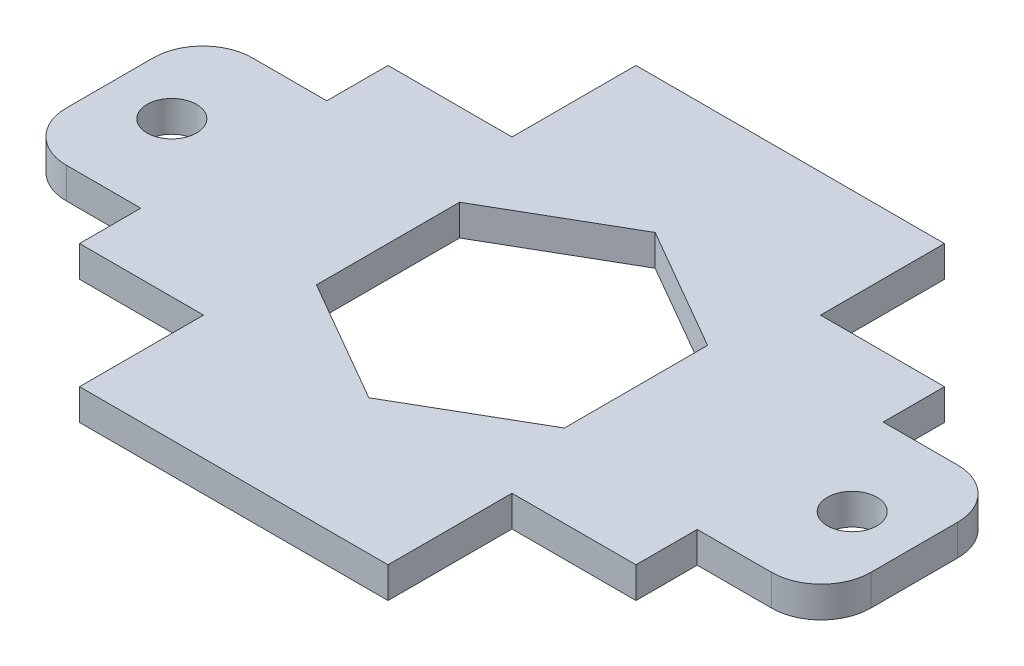
ISO-10303-21;
HEADER;
FILE_DESCRIPTION(('STEP AP214'),'2;1');
FILE_NAME('part.step','',(''),(''),'','','');
FILE_SCHEMA(('AUTOMOTIVE_DESIGN { 1 0 10303 214 1 1 1 1 }'));
ENDSEC;
DATA;
#1=APPLICATION_CONTEXT('core data for automotive mechanical design processes');
#2=APPLICATION_PROTOCOL_DEFINITION('international standard','automotive_design',2000,#1);
#3=PRODUCT_CONTEXT('',#1,'mechanical');
#4=PRODUCT('Part','Part','',(#3));
#5=PRODUCT_RELATED_PRODUCT_CATEGORY('part','',(#4));
#6=PRODUCT_DEFINITION_FORMATION('','',#4);
#7=PRODUCT_DEFINITION_CONTEXT('part definition',#1,'design');
#8=PRODUCT_DEFINITION('design','',#6,#7);
#9=PRODUCT_DEFINITION_SHAPE('','',#8);
#10=(LENGTH_UNIT() NAMED_UNIT(*) SI_UNIT(.MILLI.,.METRE.));
#11=(NAMED_UNIT(*) PLANE_ANGLE_UNIT() SI_UNIT($,.RADIAN.));
#12=(NAMED_UNIT(*) SI_UNIT($,.STERADIAN.) SOLID_ANGLE_UNIT());
#13=UNCERTAINTY_MEASURE_WITH_UNIT(LENGTH_MEASURE(1.E-05),#10,'distance_accuracy_value','');
#14=(GEOMETRIC_REPRESENTATION_CONTEXT(3) GLOBAL_UNCERTAINTY_ASSIGNED_CONTEXT((#13)) GLOBAL_UNIT_ASSIGNED_CONTEXT((#10,
#11,#12)) REPRESENTATION_CONTEXT('',''));
#15=CARTESIAN_POINT('',(0.,0.,0.));
#16=DIRECTION('',(0.,0.,1.));
#17=DIRECTION('',(1.,0.,0.));
#18=AXIS2_PLACEMENT_3D('',#15,#16,#17);
#19=CARTESIAN_POINT('',(-36.1199938,3.175,-4.44499999999998));
#20=DIRECTION('',(0.,1.,0.));
#21=DIRECTION('',(0.,0.,1.));
#22=AXIS2_PLACEMENT_3D('',#19,#20,#21);
#23=PLANE('',#22);
#24=CARTESIAN_POINT('',(-34.8499938,3.175,0.));
#25=DIRECTION('',(0.,1.,0.));
#26=DIRECTION('',(0.,0.,1.));
#27=AXIS2_PLACEMENT_3D('',#24,#25,#26);
#28=CIRCLE('',#27,2.54);
#29=CARTESIAN_POINT('',(-34.8499938,3.175,2.54000000000002));
#30=VERTEX_POINT('',#29);
#31=EDGE_CURVE('E266',#30,#30,#28,.T.);
#32=ORIENTED_EDGE('',*,*,#31,.F.);
#33=EDGE_LOOP('',(#32));
#34=FACE_BOUND('',#33,.T.);
#35=DIRECTION('',(-1.,0.,0.));
#36=VECTOR('',#35,1.);
#37=CARTESIAN_POINT('',(-28.4999938,3.175,-9.52499999999998));
#38=LINE('',#37,#36);
#39=CARTESIAN_POINT('',(-28.4999938,3.175,-9.52499999999998));
#40=VERTEX_POINT('',#39);
#41=CARTESIAN_POINT('',(-36.1199938000001,3.175,-9.52499999999998));
#42=VERTEX_POINT('',#41);
#43=EDGE_CURVE('E286',#40,#42,#38,.T.);
#44=ORIENTED_EDGE('',*,*,#43,.T.);
#45=CARTESIAN_POINT('',(-36.1199938,3.175,-4.44499999999998));
#46=DIRECTION('',(0.,1.,0.));
#47=DIRECTION('',(0.,0.,1.));
#48=AXIS2_PLACEMENT_3D('',#45,#46,#47);
#49=CIRCLE('',#48,5.08);
#50=CARTESIAN_POINT('',(-41.1999938,3.175,-4.44499999999998));
#51=VERTEX_POINT('',#50);
#52=EDGE_CURVE('E289',#42,#51,#49,.T.);
#53=ORIENTED_EDGE('',*,*,#52,.T.);
#54=DIRECTION('',(0.,0.,1.));
#55=VECTOR('',#54,1.);
#56=CARTESIAN_POINT('',(-41.1999938,3.175,4.44500000000002));
#57=LINE('',#56,#55);
#58=CARTESIAN_POINT('',(-41.1999938,3.175,4.44500000000002));
#59=VERTEX_POINT('',#58);
#60=EDGE_CURVE('E292',#51,#59,#57,.T.);
#61=ORIENTED_EDGE('',*,*,#60,.T.);
#62=CARTESIAN_POINT('',(-36.1199938,3.175,4.44500000000002));
#63=DIRECTION('',(0.,1.,0.));
#64=DIRECTION('',(0.,0.,-1.));
#65=AXIS2_PLACEMENT_3D('',#62,#63,#64);
#66=CIRCLE('',#65,5.08);
#67=CARTESIAN_POINT('',(-36.1199938000001,3.175,9.52500000000002));
#68=VERTEX_POINT('',#67);
#69=EDGE_CURVE('E294',#59,#68,#66,.T.);
#70=ORIENTED_EDGE('',*,*,#69,.T.);
#71=DIRECTION('',(1.,0.,0.));
#72=VECTOR('',#71,1.);
#73=CARTESIAN_POINT('',(-28.4999938,3.175,9.52500000000002));
#74=LINE('',#73,#72);
#75=CARTESIAN_POINT('',(-28.4999938,3.175,9.52500000000002));
#76=VERTEX_POINT('',#75);
#77=EDGE_CURVE('E296',#68,#76,#74,.T.);
#78=ORIENTED_EDGE('',*,*,#77,.T.);
#79=DIRECTION('',(0.,0.,1.));
#80=VECTOR('',#79,1.);
#81=CARTESIAN_POINT('',(-28.4999938,3.175,9.52500000000002));
#82=LINE('',#81,#80);
#83=CARTESIAN_POINT('',(-28.4999938,3.175,15.7999938));
#84=VERTEX_POINT('',#83);
#85=EDGE_CURVE('E298',#76,#84,#82,.T.);
#86=ORIENTED_EDGE('',*,*,#85,.T.);
#87=DIRECTION('',(1.,0.,0.));
#88=VECTOR('',#87,1.);
#89=CARTESIAN_POINT('',(-15.7999938,3.175,15.7999938));
#90=LINE('',#89,#88);
#91=CARTESIAN_POINT('',(-15.7999938,3.175,15.7999938));
#92=VERTEX_POINT('',#91);
#93=EDGE_CURVE('E300',#84,#92,#90,.T.);
#94=ORIENTED_EDGE('',*,*,#93,.T.);
#95=DIRECTION('',(0.,0.,1.));
#96=VECTOR('',#95,1.);
#97=CARTESIAN_POINT('',(-15.7999938,3.175,15.7999938));
#98=LINE('',#97,#96);
#99=CARTESIAN_POINT('',(-15.7999938,3.175,28.4999938));
#100=VERTEX_POINT('',#99);
#101=EDGE_CURVE('E302',#92,#100,#98,.T.);
#102=ORIENTED_EDGE('',*,*,#101,.T.);
#103=DIRECTION('',(1.,0.,0.));
#104=VECTOR('',#103,1.);
#105=CARTESIAN_POINT('',(15.7999938,3.175,28.4999938));
#106=LINE('',#105,#104);
#107=CARTESIAN_POINT('',(15.7999938,3.175,28.4999938));
#108=VERTEX_POINT('',#107);
#109=EDGE_CURVE('E304',#100,#108,#106,.T.);
#110=ORIENTED_EDGE('',*,*,#109,.T.);
#111=DIRECTION('',(0.,0.,-1.));
#112=VECTOR('',#111,1.);
#113=CARTESIAN_POINT('',(15.7999938,3.175,15.7999938));
#114=LINE('',#113,#112);
#115=CARTESIAN_POINT('',(15.7999938,3.175,15.7999938));
#116=VERTEX_POINT('',#115);
#117=EDGE_CURVE('E306',#108,#116,#114,.T.);
#118=ORIENTED_EDGE('',*,*,#117,.T.);
#119=DIRECTION('',(1.,0.,0.));
#120=VECTOR('',#119,1.);
#121=CARTESIAN_POINT('',(15.7999938,3.175,15.7999938));
#122=LINE('',#121,#120);
#123=CARTESIAN_POINT('',(28.4999938,3.175,15.7999938));
#124=VERTEX_POINT('',#123);
#125=EDGE_CURVE('E308',#116,#124,#122,.T.);
#126=ORIENTED_EDGE('',*,*,#125,.T.);
#127=DIRECTION('',(0.,0.,-1.));
#128=VECTOR('',#127,1.);
#129=CARTESIAN_POINT('',(28.4999938,3.175,9.52500000000002));
#130=LINE('',#129,#128);
#131=CARTESIAN_POINT('',(28.4999938,3.175,9.52500000000002));
#132=VERTEX_POINT('',#131);
#133=EDGE_CURVE('E310',#124,#132,#130,.T.);
#134=ORIENTED_EDGE('',*,*,#133,.T.);
#135=DIRECTION('',(1.,0.,0.));
#136=VECTOR('',#135,1.);
#137=CARTESIAN_POINT('',(28.4999938,3.175,9.52500000000002));
#138=LINE('',#137,#136);
#139=CARTESIAN_POINT('',(36.1199938,3.175,9.52500000000002));
#140=VERTEX_POINT('',#139);
#141=EDGE_CURVE('E312',#132,#140,#138,.T.);
#142=ORIENTED_EDGE('',*,*,#141,.T.);
#143=CARTESIAN_POINT('',(36.1199938,3.175,4.44500000000002));
#144=DIRECTION('',(0.,1.,0.));
#145=DIRECTION('',(0.,0.,1.));
#146=AXIS2_PLACEMENT_3D('',#143,#144,#145);
#147=CIRCLE('',#146,5.08);
#148=CARTESIAN_POINT('',(41.1999938,3.175,4.44500000000001));
#149=VERTEX_POINT('',#148);
#150=EDGE_CURVE('E314',#140,#149,#147,.T.);
#151=ORIENTED_EDGE('',*,*,#150,.T.);
#152=DIRECTION('',(0.,0.,-1.));
#153=VECTOR('',#152,1.);
#154=CARTESIAN_POINT('',(41.1999938,3.175,4.44500000000001));
#155=LINE('',#154,#153);
#156=CARTESIAN_POINT('',(41.1999938,3.175,-4.44499999999999));
#157=VERTEX_POINT('',#156);
#158=EDGE_CURVE('E316',#149,#157,#155,.T.);
#159=ORIENTED_EDGE('',*,*,#158,.T.);
#160=CARTESIAN_POINT('',(36.1199938,3.175,-4.44499999999999));
#161=DIRECTION('',(0.,1.,0.));
#162=DIRECTION('',(0.,0.,1.));
#163=AXIS2_PLACEMENT_3D('',#160,#161,#162);
#164=CIRCLE('',#163,5.08000000000001);
#165=CARTESIAN_POINT('',(36.1199938,3.175,-9.52499999999999));
#166=VERTEX_POINT('',#165);
#167=EDGE_CURVE('E318',#157,#166,#164,.T.);
#168=ORIENTED_EDGE('',*,*,#167,.T.);
#169=DIRECTION('',(-1.,0.,0.));
#170=VECTOR('',#169,1.);
#171=CARTESIAN_POINT('',(28.4999938,3.175,-9.52499999999998));
#172=LINE('',#171,#170);
#173=CARTESIAN_POINT('',(28.4999938,3.175,-9.52499999999998));
#174=VERTEX_POINT('',#173);
#175=EDGE_CURVE('E320',#166,#174,#172,.T.);
#176=ORIENTED_EDGE('',*,*,#175,.T.);
#177=DIRECTION('',(0.,0.,-1.));
#178=VECTOR('',#177,1.);
#179=CARTESIAN_POINT('',(28.4999938,3.175,-15.7999938));
#180=LINE('',#179,#178);
#181=CARTESIAN_POINT('',(28.4999938,3.175,-15.7999938));
#182=VERTEX_POINT('',#181);
#183=EDGE_CURVE('E322',#174,#182,#180,.T.);
#184=ORIENTED_EDGE('',*,*,#183,.T.);
#185=DIRECTION('',(-1.,0.,0.));
#186=VECTOR('',#185,1.);
#187=CARTESIAN_POINT('',(15.7999938,3.175,-15.7999938));
#188=LINE('',#187,#186);
#189=CARTESIAN_POINT('',(15.7999938,3.175,-15.7999938));
#190=VERTEX_POINT('',#189);
#191=EDGE_CURVE('E324',#182,#190,#188,.T.);
#192=ORIENTED_EDGE('',*,*,#191,.T.);
#193=DIRECTION('',(0.,0.,-1.));
#194=VECTOR('',#193,1.);
#195=CARTESIAN_POINT('',(15.7999938,3.175,-15.7999938));
#196=LINE('',#195,#194);
#197=CARTESIAN_POINT('',(15.7999938,3.175,-28.4999938));
#198=VERTEX_POINT('',#197);
#199=EDGE_CURVE('E326',#190,#198,#196,.T.);
#200=ORIENTED_EDGE('',*,*,#199,.T.);
#201=DIRECTION('',(-1.,0.,0.));
#202=VECTOR('',#201,1.);
#203=CARTESIAN_POINT('',(-15.7999938,3.175,-28.4999938));
#204=LINE('',#203,#202);
#205=CARTESIAN_POINT('',(-15.7999938,3.175,-28.4999938));
#206=VERTEX_POINT('',#205);
#207=EDGE_CURVE('E328',#198,#206,#204,.T.);
#208=ORIENTED_EDGE('',*,*,#207,.T.);
#209=DIRECTION('',(0.,0.,1.));
#210=VECTOR('',#209,1.);
#211=CARTESIAN_POINT('',(-15.7999938,3.175,-15.7999938));
#212=LINE('',#211,#210);
#213=CARTESIAN_POINT('',(-15.7999938,3.175,-15.7999938));
#214=VERTEX_POINT('',#213);
#215=EDGE_CURVE('E330',#206,#214,#212,.T.);
#216=ORIENTED_EDGE('',*,*,#215,.T.);
#217=DIRECTION('',(-1.,0.,0.));
#218=VECTOR('',#217,1.);
#219=CARTESIAN_POINT('',(-15.7999938,3.175,-15.7999938));
#220=LINE('',#219,#218);
#221=CARTESIAN_POINT('',(-28.4999938,3.175,-15.7999938));
#222=VERTEX_POINT('',#221);
#223=EDGE_CURVE('E332',#214,#222,#220,.T.);
#224=ORIENTED_EDGE('',*,*,#223,.T.);
#225=DIRECTION('',(0.,0.,1.));
#226=VECTOR('',#225,1.);
#227=CARTESIAN_POINT('',(-28.4999938,3.175,-15.7999938));
#228=LINE('',#227,#226);
#229=EDGE_CURVE('E334',#222,#40,#228,.T.);
#230=ORIENTED_EDGE('',*,*,#229,.T.);
#231=EDGE_LOOP('',(#44,#53,#61,#70,#78,#86,#94,#102,#110,#118,#126,#134,#142,#151,#159,#168,
#176,#184,#192,#200,#208,#216,#224,#230));
#232=FACE_BOUND('',#231,.T.);
#233=DIRECTION('',(-0.866025403784439,0.,0.5));
#234=VECTOR('',#233,1.);
#235=CARTESIAN_POINT('',(0.,3.175,-14.6646968374165));
#236=LINE('',#235,#234);
#237=CARTESIAN_POINT('',(0.,3.175,-14.6646968374165));
#238=VERTEX_POINT('',#237);
#239=CARTESIAN_POINT('',(-12.7,3.175,-7.33234841870823));
#240=VERTEX_POINT('',#239);
#241=EDGE_CURVE('E240',#238,#240,#236,.T.);
#242=ORIENTED_EDGE('',*,*,#241,.F.);
#243=DIRECTION('',(-0.866025403784439,0.,-0.5));
#244=VECTOR('',#243,1.);
#245=CARTESIAN_POINT('',(12.7,3.175,-7.33234841870823));
#246=LINE('',#245,#244);
#247=CARTESIAN_POINT('',(12.7,3.175,-7.33234841870823));
#248=VERTEX_POINT('',#247);
#249=EDGE_CURVE('E232',#248,#238,#246,.T.);
#250=ORIENTED_EDGE('',*,*,#249,.F.);
#251=DIRECTION('',(0.,0.,-1.));
#252=VECTOR('',#251,1.);
#253=CARTESIAN_POINT('',(12.7,3.175,7.33234841870827));
#254=LINE('',#253,#252);
#255=CARTESIAN_POINT('',(12.7,3.175,7.33234841870827));
#256=VERTEX_POINT('',#255);
#257=EDGE_CURVE('E263',#256,#248,#254,.T.);
#258=ORIENTED_EDGE('',*,*,#257,.F.);
#259=DIRECTION('',(0.866025403784439,0.,-0.5));
#260=VECTOR('',#259,1.);
#261=CARTESIAN_POINT('',(0.,3.175,14.6646968374165));
#262=LINE('',#261,#260);
#263=CARTESIAN_POINT('',(0.,3.175,14.6646968374165));
#264=VERTEX_POINT('',#263);
#265=EDGE_CURVE('E261',#264,#256,#262,.T.);
#266=ORIENTED_EDGE('',*,*,#265,.F.);
#267=DIRECTION('',(0.866025403784438,0.,0.5));
#268=VECTOR('',#267,1.);
#269=CARTESIAN_POINT('',(-12.7,3.175,7.33234841870827));
#270=LINE('',#269,#268);
#271=CARTESIAN_POINT('',(-12.7,3.175,7.33234841870827));
#272=VERTEX_POINT('',#271);
#273=EDGE_CURVE('E256',#272,#264,#270,.T.);
#274=ORIENTED_EDGE('',*,*,#273,.F.);
#275=DIRECTION('',(0.,0.,1.));
#276=VECTOR('',#275,1.);
#277=CARTESIAN_POINT('',(-12.7,3.175,-7.33234841870823));
#278=LINE('',#277,#276);
#279=EDGE_CURVE('E254',#240,#272,#278,.T.);
#280=ORIENTED_EDGE('',*,*,#279,.F.);
#281=EDGE_LOOP('',(#242,#250,#258,#266,#274,#280));
#282=FACE_BOUND('',#281,.T.);
#283=CARTESIAN_POINT('',(34.8499938,3.175,0.));
#284=DIRECTION('',(0.,1.,0.));
#285=DIRECTION('',(0.,0.,-1.));
#286=AXIS2_PLACEMENT_3D('',#283,#284,#285);
#287=CIRCLE('',#286,2.54000000000002);
#288=CARTESIAN_POINT('',(34.8499938,3.175,-2.54));
#289=VERTEX_POINT('',#288);
#290=EDGE_CURVE('E856',#289,#289,#287,.T.);
#291=ORIENTED_EDGE('',*,*,#290,.F.);
#292=EDGE_LOOP('',(#291));
#293=FACE_BOUND('',#292,.T.);
#294=ADVANCED_FACE('F35',(#34,#232,#282,#293),#23,.T.);
#295=CARTESIAN_POINT('',(-36.1199938,0.,-4.44499999999998));
#296=DIRECTION('',(0.,1.,0.));
#297=DIRECTION('',(0.,0.,1.));
#298=AXIS2_PLACEMENT_3D('',#295,#296,#297);
#299=PLANE('',#298);
#300=DIRECTION('',(-1.,0.,0.));
#301=VECTOR('',#300,1.);
#302=CARTESIAN_POINT('',(-28.4999938,0.,-9.52499999999998));
#303=LINE('',#302,#301);
#304=CARTESIAN_POINT('',(-28.4999938,0.,-9.52499999999998));
#305=VERTEX_POINT('',#304);
#306=CARTESIAN_POINT('',(-36.1199938000001,0.,-9.52499999999998));
#307=VERTEX_POINT('',#306);
#308=EDGE_CURVE('E248',#305,#307,#303,.T.);
#309=ORIENTED_EDGE('',*,*,#308,.F.);
#310=DIRECTION('',(0.,0.,1.));
#311=VECTOR('',#310,1.);
#312=CARTESIAN_POINT('',(-28.4999938,0.,-15.7999938));
#313=LINE('',#312,#311);
#314=CARTESIAN_POINT('',(-28.4999938,0.,-15.7999938));
#315=VERTEX_POINT('',#314);
#316=EDGE_CURVE('E290',#315,#305,#313,.T.);
#317=ORIENTED_EDGE('',*,*,#316,.F.);
#318=DIRECTION('',(-1.,0.,0.));
#319=VECTOR('',#318,1.);
#320=CARTESIAN_POINT('',(-15.7999938,0.,-15.7999938));
#321=LINE('',#320,#319);
#322=CARTESIAN_POINT('',(-15.7999938,0.,-15.7999938));
#323=VERTEX_POINT('',#322);
#324=EDGE_CURVE('E381',#323,#315,#321,.T.);
#325=ORIENTED_EDGE('',*,*,#324,.F.);
#326=DIRECTION('',(0.,0.,1.));
#327=VECTOR('',#326,1.);
#328=CARTESIAN_POINT('',(-15.7999938,0.,-15.7999938));
#329=LINE('',#328,#327);
#330=CARTESIAN_POINT('',(-15.7999938,0.,-28.4999938));
#331=VERTEX_POINT('',#330);
#332=EDGE_CURVE('E379',#331,#323,#329,.T.);
#333=ORIENTED_EDGE('',*,*,#332,.F.);
#334=DIRECTION('',(-1.,0.,0.));
#335=VECTOR('',#334,1.);
#336=CARTESIAN_POINT('',(-15.7999938,0.,-28.4999938));
#337=LINE('',#336,#335);
#338=CARTESIAN_POINT('',(15.7999938,0.,-28.4999938));
#339=VERTEX_POINT('',#338);
#340=EDGE_CURVE('E377',#339,#331,#337,.T.);
#341=ORIENTED_EDGE('',*,*,#340,.F.);
#342=DIRECTION('',(0.,0.,-1.));
#343=VECTOR('',#342,1.);
#344=CARTESIAN_POINT('',(15.7999938,0.,-15.7999938));
#345=LINE('',#344,#343);
#346=CARTESIAN_POINT('',(15.7999938,0.,-15.7999938));
#347=VERTEX_POINT('',#346);
#348=EDGE_CURVE('E375',#347,#339,#345,.T.);
#349=ORIENTED_EDGE('',*,*,#348,.F.);
#350=DIRECTION('',(-1.,0.,0.));
#351=VECTOR('',#350,1.);
#352=CARTESIAN_POINT('',(15.7999938,0.,-15.7999938));
#353=LINE('',#352,#351);
#354=CARTESIAN_POINT('',(28.4999938,0.,-15.7999938));
#355=VERTEX_POINT('',#354);
#356=EDGE_CURVE('E373',#355,#347,#353,.T.);
#357=ORIENTED_EDGE('',*,*,#356,.F.);
#358=DIRECTION('',(0.,0.,-1.));
#359=VECTOR('',#358,1.);
#360=CARTESIAN_POINT('',(28.4999938,0.,-15.7999938));
#361=LINE('',#360,#359);
#362=CARTESIAN_POINT('',(28.4999938,0.,-9.52499999999998));
#363=VERTEX_POINT('',#362);
#364=EDGE_CURVE('E371',#363,#355,#361,.T.);
#365=ORIENTED_EDGE('',*,*,#364,.F.);
#366=DIRECTION('',(-1.,0.,0.));
#367=VECTOR('',#366,1.);
#368=CARTESIAN_POINT('',(28.4999938,0.,-9.52499999999998));
#369=LINE('',#368,#367);
#370=CARTESIAN_POINT('',(36.1199938,0.,-9.52499999999999));
#371=VERTEX_POINT('',#370);
#372=EDGE_CURVE('E369',#371,#363,#369,.T.);
#373=ORIENTED_EDGE('',*,*,#372,.F.);
#374=CARTESIAN_POINT('',(36.1199938,0.,-4.44499999999999));
#375=DIRECTION('',(0.,1.,0.));
#376=DIRECTION('',(0.,0.,1.));
#377=AXIS2_PLACEMENT_3D('',#374,#375,#376);
#378=CIRCLE('',#377,5.08000000000001);
#379=CARTESIAN_POINT('',(41.1999938,0.,-4.44499999999999));
#380=VERTEX_POINT('',#379);
#381=EDGE_CURVE('E367',#380,#371,#378,.T.);
#382=ORIENTED_EDGE('',*,*,#381,.F.);
#383=DIRECTION('',(0.,0.,-1.));
#384=VECTOR('',#383,1.);
#385=CARTESIAN_POINT('',(41.1999938,0.,4.44500000000001));
#386=LINE('',#385,#384);
#387=CARTESIAN_POINT('',(41.1999938,0.,4.44500000000001));
#388=VERTEX_POINT('',#387);
#389=EDGE_CURVE('E365',#388,#380,#386,.T.);
#390=ORIENTED_EDGE('',*,*,#389,.F.);
#391=CARTESIAN_POINT('',(36.1199938,0.,4.44500000000002));
#392=DIRECTION('',(0.,1.,0.));
#393=DIRECTION('',(0.,0.,1.));
#394=AXIS2_PLACEMENT_3D('',#391,#392,#393);
#395=CIRCLE('',#394,5.08);
#396=CARTESIAN_POINT('',(36.1199938,0.,9.52500000000002));
#397=VERTEX_POINT('',#396);
#398=EDGE_CURVE('E363',#397,#388,#395,.T.);
#399=ORIENTED_EDGE('',*,*,#398,.F.);
#400=DIRECTION('',(1.,0.,0.));
#401=VECTOR('',#400,1.);
#402=CARTESIAN_POINT('',(28.4999938,0.,9.52500000000002));
#403=LINE('',#402,#401);
#404=CARTESIAN_POINT('',(28.4999938,0.,9.52500000000002));
#405=VERTEX_POINT('',#404);
#406=EDGE_CURVE('E361',#405,#397,#403,.T.);
#407=ORIENTED_EDGE('',*,*,#406,.F.);
#408=DIRECTION('',(0.,0.,-1.));
#409=VECTOR('',#408,1.);
#410=CARTESIAN_POINT('',(28.4999938,0.,9.52500000000002));
#411=LINE('',#410,#409);
#412=CARTESIAN_POINT('',(28.4999938,0.,15.7999938));
#413=VERTEX_POINT('',#412);
#414=EDGE_CURVE('E359',#413,#405,#411,.T.);
#415=ORIENTED_EDGE('',*,*,#414,.F.);
#416=DIRECTION('',(1.,0.,0.));
#417=VECTOR('',#416,1.);
#418=CARTESIAN_POINT('',(15.7999938,0.,15.7999938));
#419=LINE('',#418,#417);
#420=CARTESIAN_POINT('',(15.7999938,0.,15.7999938));
#421=VERTEX_POINT('',#420);
#422=EDGE_CURVE('E357',#421,#413,#419,.T.);
#423=ORIENTED_EDGE('',*,*,#422,.F.);
#424=DIRECTION('',(0.,0.,-1.));
#425=VECTOR('',#424,1.);
#426=CARTESIAN_POINT('',(15.7999938,0.,15.7999938));
#427=LINE('',#426,#425);
#428=CARTESIAN_POINT('',(15.7999938,0.,28.4999938));
#429=VERTEX_POINT('',#428);
#430=EDGE_CURVE('E355',#429,#421,#427,.T.);
#431=ORIENTED_EDGE('',*,*,#430,.F.);
#432=DIRECTION('',(1.,0.,0.));
#433=VECTOR('',#432,1.);
#434=CARTESIAN_POINT('',(15.7999938,0.,28.4999938));
#435=LINE('',#434,#433);
#436=CARTESIAN_POINT('',(-15.7999938,0.,28.4999938));
#437=VERTEX_POINT('',#436);
#438=EDGE_CURVE('E353',#437,#429,#435,.T.);
#439=ORIENTED_EDGE('',*,*,#438,.F.);
#440=DIRECTION('',(0.,0.,1.));
#441=VECTOR('',#440,1.);
#442=CARTESIAN_POINT('',(-15.7999938,0.,15.7999938));
#443=LINE('',#442,#441);
#444=CARTESIAN_POINT('',(-15.7999938,0.,15.7999938));
#445=VERTEX_POINT('',#444);
#446=EDGE_CURVE('E351',#445,#437,#443,.T.);
#447=ORIENTED_EDGE('',*,*,#446,.F.);
#448=DIRECTION('',(1.,0.,0.));
#449=VECTOR('',#448,1.);
#450=CARTESIAN_POINT('',(-15.7999938,0.,15.7999938));
#451=LINE('',#450,#449);
#452=CARTESIAN_POINT('',(-28.4999938,0.,15.7999938));
#453=VERTEX_POINT('',#452);
#454=EDGE_CURVE('E349',#453,#445,#451,.T.);
#455=ORIENTED_EDGE('',*,*,#454,.F.);
#456=DIRECTION('',(0.,0.,1.));
#457=VECTOR('',#456,1.);
#458=CARTESIAN_POINT('',(-28.4999938,0.,9.52500000000002));
#459=LINE('',#458,#457);
#460=CARTESIAN_POINT('',(-28.4999938,0.,9.52500000000002));
#461=VERTEX_POINT('',#460);
#462=EDGE_CURVE('E347',#461,#453,#459,.T.);
#463=ORIENTED_EDGE('',*,*,#462,.F.);
#464=DIRECTION('',(1.,0.,0.));
#465=VECTOR('',#464,1.);
#466=CARTESIAN_POINT('',(-28.4999938,0.,9.52500000000002));
#467=LINE('',#466,#465);
#468=CARTESIAN_POINT('',(-36.1199938000001,0.,9.52500000000002));
#469=VERTEX_POINT('',#468);
#470=EDGE_CURVE('E345',#469,#461,#467,.T.);
#471=ORIENTED_EDGE('',*,*,#470,.F.);
#472=CARTESIAN_POINT('',(-36.1199938,0.,4.44500000000002));
#473=DIRECTION('',(0.,1.,0.));
#474=DIRECTION('',(0.,0.,-1.));
#475=AXIS2_PLACEMENT_3D('',#472,#473,#474);
#476=CIRCLE('',#475,5.08);
#477=CARTESIAN_POINT('',(-41.1999938,0.,4.44500000000002));
#478=VERTEX_POINT('',#477);
#479=EDGE_CURVE('E343',#478,#469,#476,.T.);
#480=ORIENTED_EDGE('',*,*,#479,.F.);
#481=DIRECTION('',(0.,0.,1.));
#482=VECTOR('',#481,1.);
#483=CARTESIAN_POINT('',(-41.1999938,0.,4.44500000000002));
#484=LINE('',#483,#482);
#485=CARTESIAN_POINT('',(-41.1999938,0.,-4.44499999999998));
#486=VERTEX_POINT('',#485);
#487=EDGE_CURVE('E341',#486,#478,#484,.T.);
#488=ORIENTED_EDGE('',*,*,#487,.F.);
#489=CARTESIAN_POINT('',(-36.1199938,0.,-4.44499999999998));
#490=DIRECTION('',(0.,1.,0.));
#491=DIRECTION('',(0.,0.,1.));
#492=AXIS2_PLACEMENT_3D('',#489,#490,#491);
#493=CIRCLE('',#492,5.08);
#494=EDGE_CURVE('E339',#307,#486,#493,.T.);
#495=ORIENTED_EDGE('',*,*,#494,.F.);
#496=EDGE_LOOP('',(#309,#317,#325,#333,#341,#349,#357,#365,#373,#382,#390,#399,#407,#415,#423,
#431,#439,#447,#455,#463,#471,#480,#488,#495));
#497=FACE_BOUND('',#496,.T.);
#498=DIRECTION('',(-0.866025403784439,0.,-0.5));
#499=VECTOR('',#498,1.);
#500=CARTESIAN_POINT('',(12.7,0.,-7.33234841870823));
#501=LINE('',#500,#499);
#502=CARTESIAN_POINT('',(12.7,0.,-7.33234841870823));
#503=VERTEX_POINT('',#502);
#504=CARTESIAN_POINT('',(0.,0.,-14.6646968374165));
#505=VERTEX_POINT('',#504);
#506=EDGE_CURVE('E58',#503,#505,#501,.T.);
#507=ORIENTED_EDGE('',*,*,#506,.T.);
#508=DIRECTION('',(-0.866025403784439,0.,0.5));
#509=VECTOR('',#508,1.);
#510=CARTESIAN_POINT('',(0.,0.,-14.6646968374165));
#511=LINE('',#510,#509);
#512=CARTESIAN_POINT('',(-12.7,0.,-7.33234841870823));
#513=VERTEX_POINT('',#512);
#514=EDGE_CURVE('E247',#505,#513,#511,.T.);
#515=ORIENTED_EDGE('',*,*,#514,.T.);
#516=DIRECTION('',(0.,0.,1.));
#517=VECTOR('',#516,1.);
#518=CARTESIAN_POINT('',(-12.7,0.,-7.33234841870823));
#519=LINE('',#518,#517);
#520=CARTESIAN_POINT('',(-12.7,0.,7.33234841870827));
#521=VERTEX_POINT('',#520);
#522=EDGE_CURVE('E268',#513,#521,#519,.T.);
#523=ORIENTED_EDGE('',*,*,#522,.T.);
#524=DIRECTION('',(0.866025403784438,0.,0.5));
#525=VECTOR('',#524,1.);
#526=CARTESIAN_POINT('',(-12.7,0.,7.33234841870827));
#527=LINE('',#526,#525);
#528=CARTESIAN_POINT('',(0.,0.,14.6646968374165));
#529=VERTEX_POINT('',#528);
#530=EDGE_CURVE('E271',#521,#529,#527,.T.);
#531=ORIENTED_EDGE('',*,*,#530,.T.);
#532=DIRECTION('',(0.866025403784439,0.,-0.5));
#533=VECTOR('',#532,1.);
#534=CARTESIAN_POINT('',(0.,0.,14.6646968374165));
#535=LINE('',#534,#533);
#536=CARTESIAN_POINT('',(12.7,0.,7.33234841870827));
#537=VERTEX_POINT('',#536);
#538=EDGE_CURVE('E274',#529,#537,#535,.T.);
#539=ORIENTED_EDGE('',*,*,#538,.T.);
#540=DIRECTION('',(0.,0.,-1.));
#541=VECTOR('',#540,1.);
#542=CARTESIAN_POINT('',(12.7,0.,7.33234841870827));
#543=LINE('',#542,#541);
#544=EDGE_CURVE('E241',#537,#503,#543,.T.);
#545=ORIENTED_EDGE('',*,*,#544,.T.);
#546=EDGE_LOOP('',(#507,#515,#523,#531,#539,#545));
#547=FACE_BOUND('',#546,.T.);
#548=CARTESIAN_POINT('',(-34.8499938,0.,0.));
#549=DIRECTION('',(0.,1.,0.));
#550=DIRECTION('',(0.,0.,1.));
#551=AXIS2_PLACEMENT_3D('',#548,#549,#550);
#552=CIRCLE('',#551,2.54);
#553=CARTESIAN_POINT('',(-34.8499938,0.,2.54000000000002));
#554=VERTEX_POINT('',#553);
#555=EDGE_CURVE('E862',#554,#554,#552,.T.);
#556=ORIENTED_EDGE('',*,*,#555,.T.);
#557=EDGE_LOOP('',(#556));
#558=FACE_BOUND('',#557,.T.);
#559=CARTESIAN_POINT('',(34.8499938,0.,0.));
#560=DIRECTION('',(0.,1.,0.));
#561=DIRECTION('',(0.,0.,-1.));
#562=AXIS2_PLACEMENT_3D('',#559,#560,#561);
#563=CIRCLE('',#562,2.54000000000002);
#564=CARTESIAN_POINT('',(34.8499938,0.,-2.54));
#565=VERTEX_POINT('',#564);
#566=EDGE_CURVE('E859',#565,#565,#563,.T.);
#567=ORIENTED_EDGE('',*,*,#566,.T.);
#568=EDGE_LOOP('',(#567));
#569=FACE_BOUND('',#568,.T.);
#570=ADVANCED_FACE('F459',(#497,#547,#558,#569),#299,.F.);
#571=CARTESIAN_POINT('',(-28.4999938,3.175,-9.52499999999998));
#572=DIRECTION('',(0.,0.,1.));
#573=DIRECTION('',(1.,0.,0.));
#574=AXIS2_PLACEMENT_3D('',#571,#572,#573);
#575=PLANE('',#574);
#576=ORIENTED_EDGE('',*,*,#308,.T.);
#577=DIRECTION('',(0.,-1.,0.));
#578=VECTOR('',#577,1.);
#579=CARTESIAN_POINT('',(-36.1199938000001,3.175,-9.52499999999998));
#580=LINE('',#579,#578);
#581=EDGE_CURVE('E11',#42,#307,#580,.T.);
#582=ORIENTED_EDGE('',*,*,#581,.F.);
#583=ORIENTED_EDGE('',*,*,#43,.F.);
#584=DIRECTION('',(0.,-1.,0.));
#585=VECTOR('',#584,1.);
#586=CARTESIAN_POINT('',(-28.4999938,3.175,-9.52499999999998));
#587=LINE('',#586,#585);
#588=EDGE_CURVE('E336',#40,#305,#587,.T.);
#589=ORIENTED_EDGE('',*,*,#588,.T.);
#590=EDGE_LOOP('',(#576,#582,#583,#589));
#591=FACE_BOUND('',#590,.T.);
#592=ADVANCED_FACE('F37',(#591),#575,.F.);
#593=CARTESIAN_POINT('',(-36.1199938,3.175,-4.44499999999998));
#594=DIRECTION('',(0.,-1.,0.));
#595=DIRECTION('',(0.,0.,-1.));
#596=AXIS2_PLACEMENT_3D('',#593,#594,#595);
#597=CYLINDRICAL_SURFACE('',#596,5.08);
#598=ORIENTED_EDGE('',*,*,#494,.T.);
#599=DIRECTION('',(0.,-1.,0.));
#600=VECTOR('',#599,1.);
#601=CARTESIAN_POINT('',(-41.1999938,3.175,-4.44499999999998));
#602=LINE('',#601,#600);
#603=EDGE_CURVE('E43',#51,#486,#602,.T.);
#604=ORIENTED_EDGE('',*,*,#603,.F.);
#605=ORIENTED_EDGE('',*,*,#52,.F.);
#606=ORIENTED_EDGE('',*,*,#581,.T.);
#607=EDGE_LOOP('',(#598,#604,#605,#606));
#608=FACE_BOUND('',#607,.T.);
#609=ADVANCED_FACE('F476',(#608),#597,.T.);
#610=CARTESIAN_POINT('',(-41.1999938,3.175,4.44500000000002));
#611=DIRECTION('',(1.,0.,0.));
#612=DIRECTION('',(0.,0.,-1.));
#613=AXIS2_PLACEMENT_3D('',#610,#611,#612);
#614=PLANE('',#613);
#615=ORIENTED_EDGE('',*,*,#487,.T.);
#616=DIRECTION('',(0.,-1.,0.));
#617=VECTOR('',#616,1.);
#618=CARTESIAN_POINT('',(-41.1999938,3.175,4.44500000000002));
#619=LINE('',#618,#617);
#620=EDGE_CURVE('E446',#59,#478,#619,.T.);
#621=ORIENTED_EDGE('',*,*,#620,.F.);
#622=ORIENTED_EDGE('',*,*,#60,.F.);
#623=ORIENTED_EDGE('',*,*,#603,.T.);
#624=EDGE_LOOP('',(#615,#621,#622,#623));
#625=FACE_BOUND('',#624,.T.);
#626=ADVANCED_FACE('F453',(#625),#614,.F.);
#627=CARTESIAN_POINT('',(-36.1199938,3.175,4.44500000000002));
#628=DIRECTION('',(0.,-1.,0.));
#629=DIRECTION('',(0.,0.,-1.));
#630=AXIS2_PLACEMENT_3D('',#627,#628,#629);
#631=CYLINDRICAL_SURFACE('',#630,5.08);
#632=ORIENTED_EDGE('',*,*,#479,.T.);
#633=DIRECTION('',(0.,-1.,0.));
#634=VECTOR('',#633,1.);
#635=CARTESIAN_POINT('',(-36.1199938000001,3.175,9.52500000000002));
#636=LINE('',#635,#634);
#637=EDGE_CURVE('E443',#68,#469,#636,.T.);
#638=ORIENTED_EDGE('',*,*,#637,.F.);
#639=ORIENTED_EDGE('',*,*,#69,.F.);
#640=ORIENTED_EDGE('',*,*,#620,.T.);
#641=EDGE_LOOP('',(#632,#638,#639,#640));
#642=FACE_BOUND('',#641,.T.);
#643=ADVANCED_FACE('F465',(#642),#631,.T.);
#644=CARTESIAN_POINT('',(-28.4999938,3.175,9.52500000000002));
#645=DIRECTION('',(0.,0.,-1.));
#646=DIRECTION('',(-1.,0.,0.));
#647=AXIS2_PLACEMENT_3D('',#644,#645,#646);
#648=PLANE('',#647);
#649=ORIENTED_EDGE('',*,*,#470,.T.);
#650=DIRECTION('',(0.,-1.,0.));
#651=VECTOR('',#650,1.);
#652=CARTESIAN_POINT('',(-28.4999938,3.175,9.52500000000002));
#653=LINE('',#652,#651);
#654=EDGE_CURVE('E440',#76,#461,#653,.T.);
#655=ORIENTED_EDGE('',*,*,#654,.F.);
#656=ORIENTED_EDGE('',*,*,#77,.F.);
#657=ORIENTED_EDGE('',*,*,#637,.T.);
#658=EDGE_LOOP('',(#649,#655,#656,#657));
#659=FACE_BOUND('',#658,.T.);
#660=ADVANCED_FACE('F469',(#659),#648,.F.);
#661=CARTESIAN_POINT('',(-28.4999938,3.175,9.52500000000002));
#662=DIRECTION('',(1.,0.,0.));
#663=DIRECTION('',(0.,0.,-1.));
#664=AXIS2_PLACEMENT_3D('',#661,#662,#663);
#665=PLANE('',#664);
#666=ORIENTED_EDGE('',*,*,#462,.T.);
#667=DIRECTION('',(0.,-1.,0.));
#668=VECTOR('',#667,1.);
#669=CARTESIAN_POINT('',(-28.4999938,3.175,15.7999938));
#670=LINE('',#669,#668);
#671=EDGE_CURVE('E437',#84,#453,#670,.T.);
#672=ORIENTED_EDGE('',*,*,#671,.F.);
#673=ORIENTED_EDGE('',*,*,#85,.F.);
#674=ORIENTED_EDGE('',*,*,#654,.T.);
#675=EDGE_LOOP('',(#666,#672,#673,#674));
#676=FACE_BOUND('',#675,.T.);
#677=ADVANCED_FACE('F569',(#676),#665,.F.);
#678=CARTESIAN_POINT('',(-15.7999938,3.175,15.7999938));
#679=DIRECTION('',(0.,0.,-1.));
#680=DIRECTION('',(-1.,0.,0.));
#681=AXIS2_PLACEMENT_3D('',#678,#679,#680);
#682=PLANE('',#681);
#683=ORIENTED_EDGE('',*,*,#454,.T.);
#684=DIRECTION('',(0.,-1.,0.));
#685=VECTOR('',#684,1.);
#686=CARTESIAN_POINT('',(-15.7999938,3.175,15.7999938));
#687=LINE('',#686,#685);
#688=EDGE_CURVE('E434',#92,#445,#687,.T.);
#689=ORIENTED_EDGE('',*,*,#688,.F.);
#690=ORIENTED_EDGE('',*,*,#93,.F.);
#691=ORIENTED_EDGE('',*,*,#671,.T.);
#692=EDGE_LOOP('',(#683,#689,#690,#691));
#693=FACE_BOUND('',#692,.T.);
#694=ADVANCED_FACE('F567',(#693),#682,.F.);
#695=CARTESIAN_POINT('',(-15.7999938,3.175,15.7999938));
#696=DIRECTION('',(1.,0.,0.));
#697=DIRECTION('',(0.,0.,-1.));
#698=AXIS2_PLACEMENT_3D('',#695,#696,#697);
#699=PLANE('',#698);
#700=ORIENTED_EDGE('',*,*,#446,.T.);
#701=DIRECTION('',(0.,-1.,0.));
#702=VECTOR('',#701,1.);
#703=CARTESIAN_POINT('',(-15.7999938,3.175,28.4999938));
#704=LINE('',#703,#702);
#705=EDGE_CURVE('E431',#100,#437,#704,.T.);
#706=ORIENTED_EDGE('',*,*,#705,.F.);
#707=ORIENTED_EDGE('',*,*,#101,.F.);
#708=ORIENTED_EDGE('',*,*,#688,.T.);
#709=EDGE_LOOP('',(#700,#706,#707,#708));
#710=FACE_BOUND('',#709,.T.);
#711=ADVANCED_FACE('F563',(#710),#699,.F.);
#712=CARTESIAN_POINT('',(15.7999938,3.175,28.4999938));
#713=DIRECTION('',(0.,0.,-1.));
#714=DIRECTION('',(-1.,0.,0.));
#715=AXIS2_PLACEMENT_3D('',#712,#713,#714);
#716=PLANE('',#715);
#717=ORIENTED_EDGE('',*,*,#438,.T.);
#718=DIRECTION('',(0.,-1.,0.));
#719=VECTOR('',#718,1.);
#720=CARTESIAN_POINT('',(15.7999938,3.175,28.4999938));
#721=LINE('',#720,#719);
#722=EDGE_CURVE('E428',#108,#429,#721,.T.);
#723=ORIENTED_EDGE('',*,*,#722,.F.);
#724=ORIENTED_EDGE('',*,*,#109,.F.);
#725=ORIENTED_EDGE('',*,*,#705,.T.);
#726=EDGE_LOOP('',(#717,#723,#724,#725));
#727=FACE_BOUND('',#726,.T.);
#728=ADVANCED_FACE('F558',(#727),#716,.F.);
#729=CARTESIAN_POINT('',(15.7999938,3.175,15.7999938));
#730=DIRECTION('',(-1.,0.,0.));
#731=DIRECTION('',(0.,0.,1.));
#732=AXIS2_PLACEMENT_3D('',#729,#730,#731);
#733=PLANE('',#732);
#734=ORIENTED_EDGE('',*,*,#430,.T.);
#735=DIRECTION('',(0.,-1.,0.));
#736=VECTOR('',#735,1.);
#737=CARTESIAN_POINT('',(15.7999938,3.175,15.7999938));
#738=LINE('',#737,#736);
#739=EDGE_CURVE('E425',#116,#421,#738,.T.);
#740=ORIENTED_EDGE('',*,*,#739,.F.);
#741=ORIENTED_EDGE('',*,*,#117,.F.);
#742=ORIENTED_EDGE('',*,*,#722,.T.);
#743=EDGE_LOOP('',(#734,#740,#741,#742));
#744=FACE_BOUND('',#743,.T.);
#745=ADVANCED_FACE('F552',(#744),#733,.F.);
#746=CARTESIAN_POINT('',(15.7999938,3.175,15.7999938));
#747=DIRECTION('',(0.,0.,-1.));
#748=DIRECTION('',(-1.,0.,0.));
#749=AXIS2_PLACEMENT_3D('',#746,#747,#748);
#750=PLANE('',#749);
#751=ORIENTED_EDGE('',*,*,#422,.T.);
#752=DIRECTION('',(0.,-1.,0.));
#753=VECTOR('',#752,1.);
#754=CARTESIAN_POINT('',(28.4999938,3.175,15.7999938));
#755=LINE('',#754,#753);
#756=EDGE_CURVE('E422',#124,#413,#755,.T.);
#757=ORIENTED_EDGE('',*,*,#756,.F.);
#758=ORIENTED_EDGE('',*,*,#125,.F.);
#759=ORIENTED_EDGE('',*,*,#739,.T.);
#760=EDGE_LOOP('',(#751,#757,#758,#759));
#761=FACE_BOUND('',#760,.T.);
#762=ADVANCED_FACE('F548',(#761),#750,.F.);
#763=CARTESIAN_POINT('',(28.4999938,3.175,9.52500000000002));
#764=DIRECTION('',(-1.,0.,0.));
#765=DIRECTION('',(0.,0.,1.));
#766=AXIS2_PLACEMENT_3D('',#763,#764,#765);
#767=PLANE('',#766);
#768=ORIENTED_EDGE('',*,*,#414,.T.);
#769=DIRECTION('',(0.,-1.,0.));
#770=VECTOR('',#769,1.);
#771=CARTESIAN_POINT('',(28.4999938,3.175,9.52500000000002));
#772=LINE('',#771,#770);
#773=EDGE_CURVE('E419',#132,#405,#772,.T.);
#774=ORIENTED_EDGE('',*,*,#773,.F.);
#775=ORIENTED_EDGE('',*,*,#133,.F.);
#776=ORIENTED_EDGE('',*,*,#756,.T.);
#777=EDGE_LOOP('',(#768,#774,#775,#776));
#778=FACE_BOUND('',#777,.T.);
#779=ADVANCED_FACE('F543',(#778),#767,.F.);
#780=CARTESIAN_POINT('',(28.4999938,3.175,9.52500000000002));
#781=DIRECTION('',(0.,0.,-1.));
#782=DIRECTION('',(-1.,0.,0.));
#783=AXIS2_PLACEMENT_3D('',#780,#781,#782);
#784=PLANE('',#783);
#785=ORIENTED_EDGE('',*,*,#406,.T.);
#786=DIRECTION('',(0.,-1.,0.));
#787=VECTOR('',#786,1.);
#788=CARTESIAN_POINT('',(36.1199938,3.175,9.52500000000002));
#789=LINE('',#788,#787);
#790=EDGE_CURVE('E416',#140,#397,#789,.T.);
#791=ORIENTED_EDGE('',*,*,#790,.F.);
#792=ORIENTED_EDGE('',*,*,#141,.F.);
#793=ORIENTED_EDGE('',*,*,#773,.T.);
#794=EDGE_LOOP('',(#785,#791,#792,#793));
#795=FACE_BOUND('',#794,.T.);
#796=ADVANCED_FACE('F537',(#795),#784,.F.);
#797=CARTESIAN_POINT('',(36.1199938,3.175,4.44500000000002));
#798=DIRECTION('',(0.,-1.,0.));
#799=DIRECTION('',(0.,0.,-1.));
#800=AXIS2_PLACEMENT_3D('',#797,#798,#799);
#801=CYLINDRICAL_SURFACE('',#800,5.08);
#802=ORIENTED_EDGE('',*,*,#398,.T.);
#803=DIRECTION('',(0.,-1.,0.));
#804=VECTOR('',#803,1.);
#805=CARTESIAN_POINT('',(41.1999938,3.175,4.44500000000001));
#806=LINE('',#805,#804);
#807=EDGE_CURVE('E413',#149,#388,#806,.T.);
#808=ORIENTED_EDGE('',*,*,#807,.F.);
#809=ORIENTED_EDGE('',*,*,#150,.F.);
#810=ORIENTED_EDGE('',*,*,#790,.T.);
#811=EDGE_LOOP('',(#802,#808,#809,#810));
#812=FACE_BOUND('',#811,.T.);
#813=ADVANCED_FACE('F533',(#812),#801,.T.);
#814=CARTESIAN_POINT('',(41.1999938,3.175,4.44500000000001));
#815=DIRECTION('',(-1.,0.,0.));
#816=DIRECTION('',(0.,0.,1.));
#817=AXIS2_PLACEMENT_3D('',#814,#815,#816);
#818=PLANE('',#817);
#819=ORIENTED_EDGE('',*,*,#389,.T.);
#820=DIRECTION('',(0.,-1.,0.));
#821=VECTOR('',#820,1.);
#822=CARTESIAN_POINT('',(41.1999938,3.175,-4.44499999999999));
#823=LINE('',#822,#821);
#824=EDGE_CURVE('E410',#157,#380,#823,.T.);
#825=ORIENTED_EDGE('',*,*,#824,.F.);
#826=ORIENTED_EDGE('',*,*,#158,.F.);
#827=ORIENTED_EDGE('',*,*,#807,.T.);
#828=EDGE_LOOP('',(#819,#825,#826,#827));
#829=FACE_BOUND('',#828,.T.);
#830=ADVANCED_FACE('F528',(#829),#818,.F.);
#831=CARTESIAN_POINT('',(36.1199938,3.175,-4.44499999999999));
#832=DIRECTION('',(0.,-1.,0.));
#833=DIRECTION('',(0.,0.,-1.));
#834=AXIS2_PLACEMENT_3D('',#831,#832,#833);
#835=CYLINDRICAL_SURFACE('',#834,5.08000000000001);
#836=ORIENTED_EDGE('',*,*,#381,.T.);
#837=DIRECTION('',(0.,-1.,0.));
#838=VECTOR('',#837,1.);
#839=CARTESIAN_POINT('',(36.1199938,3.175,-9.52499999999999));
#840=LINE('',#839,#838);
#841=EDGE_CURVE('E407',#166,#371,#840,.T.);
#842=ORIENTED_EDGE('',*,*,#841,.F.);
#843=ORIENTED_EDGE('',*,*,#167,.F.);
#844=ORIENTED_EDGE('',*,*,#824,.T.);
#845=EDGE_LOOP('',(#836,#842,#843,#844));
#846=FACE_BOUND('',#845,.T.);
#847=ADVANCED_FACE('F522',(#846),#835,.T.);
#848=CARTESIAN_POINT('',(28.4999938,3.175,-9.52499999999998));
#849=DIRECTION('',(0.,0.,1.));
#850=DIRECTION('',(1.,0.,0.));
#851=AXIS2_PLACEMENT_3D('',#848,#849,#850);
#852=PLANE('',#851);
#853=ORIENTED_EDGE('',*,*,#372,.T.);
#854=DIRECTION('',(0.,-1.,0.));
#855=VECTOR('',#854,1.);
#856=CARTESIAN_POINT('',(28.4999938,3.175,-9.52499999999998));
#857=LINE('',#856,#855);
#858=EDGE_CURVE('E404',#174,#363,#857,.T.);
#859=ORIENTED_EDGE('',*,*,#858,.F.);
#860=ORIENTED_EDGE('',*,*,#175,.F.);
#861=ORIENTED_EDGE('',*,*,#841,.T.);
#862=EDGE_LOOP('',(#853,#859,#860,#861));
#863=FACE_BOUND('',#862,.T.);
#864=ADVANCED_FACE('F518',(#863),#852,.F.);
#865=CARTESIAN_POINT('',(28.4999938,3.175,-15.7999938));
#866=DIRECTION('',(-1.,0.,0.));
#867=DIRECTION('',(0.,0.,1.));
#868=AXIS2_PLACEMENT_3D('',#865,#866,#867);
#869=PLANE('',#868);
#870=ORIENTED_EDGE('',*,*,#364,.T.);
#871=DIRECTION('',(0.,-1.,0.));
#872=VECTOR('',#871,1.);
#873=CARTESIAN_POINT('',(28.4999938,3.175,-15.7999938));
#874=LINE('',#873,#872);
#875=EDGE_CURVE('E401',#182,#355,#874,.T.);
#876=ORIENTED_EDGE('',*,*,#875,.F.);
#877=ORIENTED_EDGE('',*,*,#183,.F.);
#878=ORIENTED_EDGE('',*,*,#858,.T.);
#879=EDGE_LOOP('',(#870,#876,#877,#878));
#880=FACE_BOUND('',#879,.T.);
#881=ADVANCED_FACE('F513',(#880),#869,.F.);
#882=CARTESIAN_POINT('',(15.7999938,3.175,-15.7999938));
#883=DIRECTION('',(0.,0.,1.));
#884=DIRECTION('',(1.,0.,0.));
#885=AXIS2_PLACEMENT_3D('',#882,#883,#884);
#886=PLANE('',#885);
#887=ORIENTED_EDGE('',*,*,#356,.T.);
#888=DIRECTION('',(0.,-1.,0.));
#889=VECTOR('',#888,1.);
#890=CARTESIAN_POINT('',(15.7999938,3.175,-15.7999938));
#891=LINE('',#890,#889);
#892=EDGE_CURVE('E398',#190,#347,#891,.T.);
#893=ORIENTED_EDGE('',*,*,#892,.F.);
#894=ORIENTED_EDGE('',*,*,#191,.F.);
#895=ORIENTED_EDGE('',*,*,#875,.T.);
#896=EDGE_LOOP('',(#887,#893,#894,#895));
#897=FACE_BOUND('',#896,.T.);
#898=ADVANCED_FACE('F507',(#897),#886,.F.);
#899=CARTESIAN_POINT('',(15.7999938,3.175,-15.7999938));
#900=DIRECTION('',(-1.,0.,0.));
#901=DIRECTION('',(0.,0.,1.));
#902=AXIS2_PLACEMENT_3D('',#899,#900,#901);
#903=PLANE('',#902);
#904=ORIENTED_EDGE('',*,*,#348,.T.);
#905=DIRECTION('',(0.,-1.,0.));
#906=VECTOR('',#905,1.);
#907=CARTESIAN_POINT('',(15.7999938,3.175,-28.4999938));
#908=LINE('',#907,#906);
#909=EDGE_CURVE('E395',#198,#339,#908,.T.);
#910=ORIENTED_EDGE('',*,*,#909,.F.);
#911=ORIENTED_EDGE('',*,*,#199,.F.);
#912=ORIENTED_EDGE('',*,*,#892,.T.);
#913=EDGE_LOOP('',(#904,#910,#911,#912));
#914=FACE_BOUND('',#913,.T.);
#915=ADVANCED_FACE('F503',(#914),#903,.F.);
#916=CARTESIAN_POINT('',(-15.7999938,3.175,-28.4999938));
#917=DIRECTION('',(0.,0.,1.));
#918=DIRECTION('',(1.,0.,0.));
#919=AXIS2_PLACEMENT_3D('',#916,#917,#918);
#920=PLANE('',#919);
#921=ORIENTED_EDGE('',*,*,#340,.T.);
#922=DIRECTION('',(0.,-1.,0.));
#923=VECTOR('',#922,1.);
#924=CARTESIAN_POINT('',(-15.7999938,3.175,-28.4999938));
#925=LINE('',#924,#923);
#926=EDGE_CURVE('E392',#206,#331,#925,.T.);
#927=ORIENTED_EDGE('',*,*,#926,.F.);
#928=ORIENTED_EDGE('',*,*,#207,.F.);
#929=ORIENTED_EDGE('',*,*,#909,.T.);
#930=EDGE_LOOP('',(#921,#927,#928,#929));
#931=FACE_BOUND('',#930,.T.);
#932=ADVANCED_FACE('F498',(#931),#920,.F.);
#933=CARTESIAN_POINT('',(-15.7999938,3.175,-15.7999938));
#934=DIRECTION('',(1.,0.,0.));
#935=DIRECTION('',(0.,0.,-1.));
#936=AXIS2_PLACEMENT_3D('',#933,#934,#935);
#937=PLANE('',#936);
#938=ORIENTED_EDGE('',*,*,#332,.T.);
#939=DIRECTION('',(0.,-1.,0.));
#940=VECTOR('',#939,1.);
#941=CARTESIAN_POINT('',(-15.7999938,3.175,-15.7999938));
#942=LINE('',#941,#940);
#943=EDGE_CURVE('E389',#214,#323,#942,.T.);
#944=ORIENTED_EDGE('',*,*,#943,.F.);
#945=ORIENTED_EDGE('',*,*,#215,.F.);
#946=ORIENTED_EDGE('',*,*,#926,.T.);
#947=EDGE_LOOP('',(#938,#944,#945,#946));
#948=FACE_BOUND('',#947,.T.);
#949=ADVANCED_FACE('F492',(#948),#937,.F.);
#950=CARTESIAN_POINT('',(-15.7999938,3.175,-15.7999938));
#951=DIRECTION('',(0.,0.,1.));
#952=DIRECTION('',(1.,0.,0.));
#953=AXIS2_PLACEMENT_3D('',#950,#951,#952);
#954=PLANE('',#953);
#955=ORIENTED_EDGE('',*,*,#324,.T.);
#956=DIRECTION('',(0.,-1.,0.));
#957=VECTOR('',#956,1.);
#958=CARTESIAN_POINT('',(-28.4999938,3.175,-15.7999938));
#959=LINE('',#958,#957);
#960=EDGE_CURVE('E386',#222,#315,#959,.T.);
#961=ORIENTED_EDGE('',*,*,#960,.F.);
#962=ORIENTED_EDGE('',*,*,#223,.F.);
#963=ORIENTED_EDGE('',*,*,#943,.T.);
#964=EDGE_LOOP('',(#955,#961,#962,#963));
#965=FACE_BOUND('',#964,.T.);
#966=ADVANCED_FACE('F488',(#965),#954,.F.);
#967=CARTESIAN_POINT('',(-28.4999938,3.175,-15.7999938));
#968=DIRECTION('',(1.,0.,0.));
#969=DIRECTION('',(0.,0.,-1.));
#970=AXIS2_PLACEMENT_3D('',#967,#968,#969);
#971=PLANE('',#970);
#972=ORIENTED_EDGE('',*,*,#316,.T.);
#973=ORIENTED_EDGE('',*,*,#588,.F.);
#974=ORIENTED_EDGE('',*,*,#229,.F.);
#975=ORIENTED_EDGE('',*,*,#960,.T.);
#976=EDGE_LOOP('',(#972,#973,#974,#975));
#977=FACE_BOUND('',#976,.T.);
#978=ADVANCED_FACE('F483',(#977),#971,.F.);
#979=CARTESIAN_POINT('',(12.7,3.175,-7.33234841870823));
#980=DIRECTION('',(-0.5,0.,0.866025403784439));
#981=DIRECTION('',(0.866025403784439,0.,0.5));
#982=AXIS2_PLACEMENT_3D('',#979,#980,#981);
#983=PLANE('',#982);
#984=ORIENTED_EDGE('',*,*,#506,.F.);
#985=DIRECTION('',(0.,-1.,0.));
#986=VECTOR('',#985,1.);
#987=CARTESIAN_POINT('',(12.7,3.175,-7.33234841870823));
#988=LINE('',#987,#986);
#989=EDGE_CURVE('E236',#248,#503,#988,.T.);
#990=ORIENTED_EDGE('',*,*,#989,.F.);
#991=ORIENTED_EDGE('',*,*,#249,.T.);
#992=DIRECTION('',(0.,-1.,0.));
#993=VECTOR('',#992,1.);
#994=CARTESIAN_POINT('',(0.,3.175,-14.6646968374165));
#995=LINE('',#994,#993);
#996=EDGE_CURVE('E235',#238,#505,#995,.T.);
#997=ORIENTED_EDGE('',*,*,#996,.T.);
#998=EDGE_LOOP('',(#984,#990,#991,#997));
#999=FACE_BOUND('',#998,.T.);
#1000=ADVANCED_FACE('F234',(#999),#983,.T.);
#1001=CARTESIAN_POINT('',(0.,3.175,-14.6646968374165));
#1002=DIRECTION('',(0.5,0.,0.866025403784439));
#1003=DIRECTION('',(0.866025403784439,0.,-0.5));
#1004=AXIS2_PLACEMENT_3D('',#1001,#1002,#1003);
#1005=PLANE('',#1004);
#1006=ORIENTED_EDGE('',*,*,#514,.F.);
#1007=ORIENTED_EDGE('',*,*,#996,.F.);
#1008=ORIENTED_EDGE('',*,*,#241,.T.);
#1009=DIRECTION('',(0.,-1.,0.));
#1010=VECTOR('',#1009,1.);
#1011=CARTESIAN_POINT('',(-12.7,3.175,-7.33234841870823));
#1012=LINE('',#1011,#1010);
#1013=EDGE_CURVE('E249',#240,#513,#1012,.T.);
#1014=ORIENTED_EDGE('',*,*,#1013,.T.);
#1015=EDGE_LOOP('',(#1006,#1007,#1008,#1014));
#1016=FACE_BOUND('',#1015,.T.);
#1017=ADVANCED_FACE('F244',(#1016),#1005,.T.);
#1018=CARTESIAN_POINT('',(-12.7,3.175,-7.33234841870823));
#1019=DIRECTION('',(1.,0.,0.));
#1020=DIRECTION('',(0.,0.,-1.));
#1021=AXIS2_PLACEMENT_3D('',#1018,#1019,#1020);
#1022=PLANE('',#1021);
#1023=ORIENTED_EDGE('',*,*,#522,.F.);
#1024=ORIENTED_EDGE('',*,*,#1013,.F.);
#1025=ORIENTED_EDGE('',*,*,#279,.T.);
#1026=DIRECTION('',(0.,-1.,0.));
#1027=VECTOR('',#1026,1.);
#1028=CARTESIAN_POINT('',(-12.7,3.175,7.33234841870827));
#1029=LINE('',#1028,#1027);
#1030=EDGE_CURVE('E283',#272,#521,#1029,.T.);
#1031=ORIENTED_EDGE('',*,*,#1030,.T.);
#1032=EDGE_LOOP('',(#1023,#1024,#1025,#1031));
#1033=FACE_BOUND('',#1032,.T.);
#1034=ADVANCED_FACE('F701',(#1033),#1022,.T.);
#1035=CARTESIAN_POINT('',(-12.7,3.175,7.33234841870827));
#1036=DIRECTION('',(0.5,0.,-0.866025403784439));
#1037=DIRECTION('',(-0.866025403784439,0.,-0.5));
#1038=AXIS2_PLACEMENT_3D('',#1035,#1036,#1037);
#1039=PLANE('',#1038);
#1040=ORIENTED_EDGE('',*,*,#530,.F.);
#1041=ORIENTED_EDGE('',*,*,#1030,.F.);
#1042=ORIENTED_EDGE('',*,*,#273,.T.);
#1043=DIRECTION('',(0.,-1.,0.));
#1044=VECTOR('',#1043,1.);
#1045=CARTESIAN_POINT('',(0.,3.175,14.6646968374165));
#1046=LINE('',#1045,#1044);
#1047=EDGE_CURVE('E281',#264,#529,#1046,.T.);
#1048=ORIENTED_EDGE('',*,*,#1047,.T.);
#1049=EDGE_LOOP('',(#1040,#1041,#1042,#1048));
#1050=FACE_BOUND('',#1049,.T.);
#1051=ADVANCED_FACE('F707',(#1050),#1039,.T.);
#1052=CARTESIAN_POINT('',(0.,3.175,14.6646968374165));
#1053=DIRECTION('',(-0.5,0.,-0.866025403784439));
#1054=DIRECTION('',(-0.866025403784439,0.,0.5));
#1055=AXIS2_PLACEMENT_3D('',#1052,#1053,#1054);
#1056=PLANE('',#1055);
#1057=ORIENTED_EDGE('',*,*,#538,.F.);
#1058=ORIENTED_EDGE('',*,*,#1047,.F.);
#1059=ORIENTED_EDGE('',*,*,#265,.T.);
#1060=DIRECTION('',(0.,-1.,0.));
#1061=VECTOR('',#1060,1.);
#1062=CARTESIAN_POINT('',(12.7,3.175,7.33234841870827));
#1063=LINE('',#1062,#1061);
#1064=EDGE_CURVE('E50',#256,#537,#1063,.T.);
#1065=ORIENTED_EDGE('',*,*,#1064,.T.);
#1066=EDGE_LOOP('',(#1057,#1058,#1059,#1065));
#1067=FACE_BOUND('',#1066,.T.);
#1068=ADVANCED_FACE('F715',(#1067),#1056,.T.);
#1069=CARTESIAN_POINT('',(12.7,3.175,7.33234841870827));
#1070=DIRECTION('',(-1.,0.,0.));
#1071=DIRECTION('',(0.,0.,1.));
#1072=AXIS2_PLACEMENT_3D('',#1069,#1070,#1071);
#1073=PLANE('',#1072);
#1074=ORIENTED_EDGE('',*,*,#544,.F.);
#1075=ORIENTED_EDGE('',*,*,#1064,.F.);
#1076=ORIENTED_EDGE('',*,*,#257,.T.);
#1077=ORIENTED_EDGE('',*,*,#989,.T.);
#1078=EDGE_LOOP('',(#1074,#1075,#1076,#1077));
#1079=FACE_BOUND('',#1078,.T.);
#1080=ADVANCED_FACE('F723',(#1079),#1073,.T.);
#1081=CARTESIAN_POINT('',(-34.8499938,3.175,0.));
#1082=DIRECTION('',(0.,-1.,0.));
#1083=DIRECTION('',(0.,0.,-1.));
#1084=AXIS2_PLACEMENT_3D('',#1081,#1082,#1083);
#1085=CYLINDRICAL_SURFACE('',#1084,2.54);
#1086=ORIENTED_EDGE('',*,*,#31,.T.);
#1087=EDGE_LOOP('',(#1086));
#1088=FACE_BOUND('',#1087,.T.);
#1089=ORIENTED_EDGE('',*,*,#555,.F.);
#1090=EDGE_LOOP('',(#1089));
#1091=FACE_BOUND('',#1090,.T.);
#1092=ADVANCED_FACE('F731',(#1088,#1091),#1085,.F.);
#1093=CARTESIAN_POINT('',(34.8499938,3.175,0.));
#1094=DIRECTION('',(0.,-1.,0.));
#1095=DIRECTION('',(0.,0.,-1.));
#1096=AXIS2_PLACEMENT_3D('',#1093,#1094,#1095);
#1097=CYLINDRICAL_SURFACE('',#1096,2.54000000000002);
#1098=ORIENTED_EDGE('',*,*,#290,.T.);
#1099=EDGE_LOOP('',(#1098));
#1100=FACE_BOUND('',#1099,.T.);
#1101=ORIENTED_EDGE('',*,*,#566,.F.);
#1102=EDGE_LOOP('',(#1101));
#1103=FACE_BOUND('',#1102,.T.);
#1104=ADVANCED_FACE('F738',(#1100,#1103),#1097,.F.);
#1105=CLOSED_SHELL('',(#294,#570,#592,#609,#626,#643,#660,#677,#694,#711,#728,#745,#762,#779,
#796,#813,#830,#847,#864,#881,#898,#915,#932,#949,#966,#978,#1000,#1017,#1034,#1051,#1068,#1080,
#1092,#1104));
#1106=MANIFOLD_SOLID_BREP('B2',#1105);
#1107=ADVANCED_BREP_SHAPE_REPRESENTATION('',(#18,#1106),#14);
#1108=SHAPE_DEFINITION_REPRESENTATION(#9,#1107);
ENDSEC;
END-ISO-10303-21;
